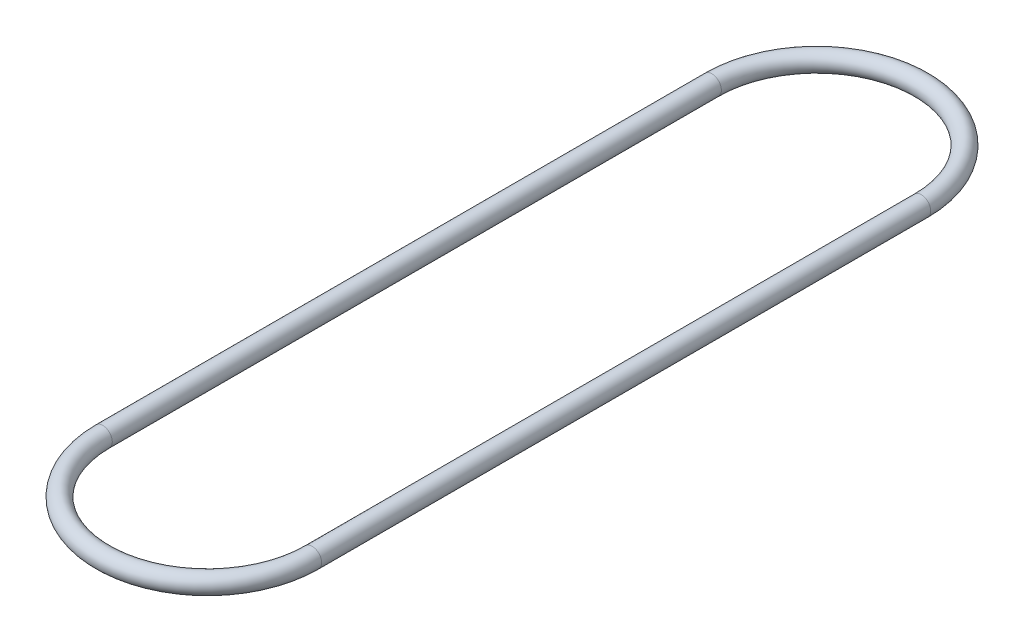
ISO-10303-21;
HEADER;
FILE_DESCRIPTION(('STEP AP214'),'2;1');
FILE_NAME('part.step','',(''),(''),'','','');
FILE_SCHEMA(('AUTOMOTIVE_DESIGN { 1 0 10303 214 1 1 1 1 }'));
ENDSEC;
DATA;
#1=APPLICATION_CONTEXT('core data for automotive mechanical design processes');
#2=APPLICATION_PROTOCOL_DEFINITION('international standard','automotive_design',2000,#1);
#3=PRODUCT_CONTEXT('',#1,'mechanical');
#4=PRODUCT('Part','Part','',(#3));
#5=PRODUCT_RELATED_PRODUCT_CATEGORY('part','',(#4));
#6=PRODUCT_DEFINITION_FORMATION('','',#4);
#7=PRODUCT_DEFINITION_CONTEXT('part definition',#1,'design');
#8=PRODUCT_DEFINITION('design','',#6,#7);
#9=PRODUCT_DEFINITION_SHAPE('','',#8);
#10=(LENGTH_UNIT() NAMED_UNIT(*) SI_UNIT(.MILLI.,.METRE.));
#11=(NAMED_UNIT(*) PLANE_ANGLE_UNIT() SI_UNIT($,.RADIAN.));
#12=(NAMED_UNIT(*) SI_UNIT($,.STERADIAN.) SOLID_ANGLE_UNIT());
#13=UNCERTAINTY_MEASURE_WITH_UNIT(LENGTH_MEASURE(1.E-05),#10,'distance_accuracy_value','');
#14=(GEOMETRIC_REPRESENTATION_CONTEXT(3) GLOBAL_UNCERTAINTY_ASSIGNED_CONTEXT((#13)) GLOBAL_UNIT_ASSIGNED_CONTEXT((#10,
#11,#12)) REPRESENTATION_CONTEXT('',''));
#15=CARTESIAN_POINT('',(0.,0.,0.));
#16=DIRECTION('',(0.,0.,1.));
#17=DIRECTION('',(1.,0.,0.));
#18=AXIS2_PLACEMENT_3D('',#15,#16,#17);
#19=CARTESIAN_POINT('',(0.,0.,-203.2));
#20=DIRECTION('',(0.,0.,1.));
#21=DIRECTION('',(1.,0.,0.));
#22=AXIS2_PLACEMENT_3D('',#19,#20,#21);
#23=CYLINDRICAL_SURFACE('',#22,3.175);
#24=CARTESIAN_POINT('',(0.,0.,0.));
#25=DIRECTION('',(0.,0.,1.));
#26=DIRECTION('',(1.,0.,0.));
#27=AXIS2_PLACEMENT_3D('',#24,#25,#26);
#28=CIRCLE('',#27,3.175);
#29=CARTESIAN_POINT('',(-3.175,0.,0.));
#30=VERTEX_POINT('',#29);
#31=EDGE_CURVE('E47',#30,#30,#28,.T.);
#32=ORIENTED_EDGE('',*,*,#31,.F.);
#33=EDGE_LOOP('',(#32));
#34=FACE_BOUND('',#33,.T.);
#35=CARTESIAN_POINT('',(0.,0.,-203.2));
#36=DIRECTION('',(0.,0.,1.));
#37=DIRECTION('',(1.,0.,0.));
#38=AXIS2_PLACEMENT_3D('',#35,#36,#37);
#39=CIRCLE('',#38,3.175);
#40=CARTESIAN_POINT('',(-3.175,0.,-203.2));
#41=VERTEX_POINT('',#40);
#42=EDGE_CURVE('E10',#41,#41,#39,.T.);
#43=ORIENTED_EDGE('',*,*,#42,.T.);
#44=EDGE_LOOP('',(#43));
#45=FACE_BOUND('',#44,.T.);
#46=ADVANCED_FACE('F32',(#34,#45),#23,.T.);
#47=CARTESIAN_POINT('',(34.925,0.,-203.2));
#48=DIRECTION('',(0.,1.,0.));
#49=DIRECTION('',(0.,0.,1.));
#50=AXIS2_PLACEMENT_3D('',#47,#48,#49);
#51=TOROIDAL_SURFACE('',#50,34.925,3.175);
#52=CARTESIAN_POINT('',(69.85,0.,-203.2));
#53=DIRECTION('',(0.,0.,-1.));
#54=DIRECTION('',(-1.,0.,0.));
#55=AXIS2_PLACEMENT_3D('',#52,#53,#54);
#56=CIRCLE('',#55,3.175);
#57=CARTESIAN_POINT('',(73.025,0.,-203.2));
#58=VERTEX_POINT('',#57);
#59=EDGE_CURVE('E39',#58,#58,#56,.T.);
#60=CARTESIAN_POINT('',(34.925,0.,-203.2));
#61=DIRECTION('',(0.,1.,0.));
#62=DIRECTION('',(0.,0.,1.));
#63=AXIS2_PLACEMENT_3D('',#60,#61,#62);
#64=CIRCLE('',#63,38.1);
#65=EDGE_CURVE('',#58,#41,#64,.T.);
#66=ORIENTED_EDGE('',*,*,#59,.T.);
#67=ORIENTED_EDGE('',*,*,#42,.F.);
#68=ORIENTED_EDGE('',*,*,#65,.T.);
#69=ORIENTED_EDGE('',*,*,#65,.F.);
#70=EDGE_LOOP('',(#66,#68,#67,#69));
#71=FACE_BOUND('',#70,.T.);
#72=ADVANCED_FACE('F56',(#71),#51,.T.);
#73=CARTESIAN_POINT('',(69.85,0.,0.));
#74=DIRECTION('',(0.,0.,-1.));
#75=DIRECTION('',(-1.,0.,0.));
#76=AXIS2_PLACEMENT_3D('',#73,#74,#75);
#77=CYLINDRICAL_SURFACE('',#76,3.175);
#78=ORIENTED_EDGE('',*,*,#59,.F.);
#79=EDGE_LOOP('',(#78));
#80=FACE_BOUND('',#79,.T.);
#81=CARTESIAN_POINT('',(69.85,0.,0.));
#82=DIRECTION('',(0.,0.,-1.));
#83=DIRECTION('',(-1.,0.,0.));
#84=AXIS2_PLACEMENT_3D('',#81,#82,#83);
#85=CIRCLE('',#84,3.175);
#86=CARTESIAN_POINT('',(73.025,0.,0.));
#87=VERTEX_POINT('',#86);
#88=EDGE_CURVE('E43',#87,#87,#85,.T.);
#89=ORIENTED_EDGE('',*,*,#88,.T.);
#90=EDGE_LOOP('',(#89));
#91=FACE_BOUND('',#90,.T.);
#92=ADVANCED_FACE('F60',(#80,#91),#77,.T.);
#93=CARTESIAN_POINT('',(34.925,0.,0.));
#94=DIRECTION('',(0.,1.,0.));
#95=DIRECTION('',(0.,0.,1.));
#96=AXIS2_PLACEMENT_3D('',#93,#94,#95);
#97=TOROIDAL_SURFACE('',#96,34.925,3.175);
#98=CARTESIAN_POINT('',(34.925,0.,0.));
#99=DIRECTION('',(0.,1.,0.));
#100=DIRECTION('',(0.,0.,1.));
#101=AXIS2_PLACEMENT_3D('',#98,#99,#100);
#102=CIRCLE('',#101,38.1);
#103=EDGE_CURVE('',#30,#87,#102,.T.);
#104=ORIENTED_EDGE('',*,*,#31,.T.);
#105=ORIENTED_EDGE('',*,*,#88,.F.);
#106=ORIENTED_EDGE('',*,*,#103,.T.);
#107=ORIENTED_EDGE('',*,*,#103,.F.);
#108=EDGE_LOOP('',(#104,#106,#105,#107));
#109=FACE_BOUND('',#108,.T.);
#110=ADVANCED_FACE('F53',(#109),#97,.T.);
#111=CLOSED_SHELL('',(#46,#72,#92,#110));
#112=MANIFOLD_SOLID_BREP('B2',#111);
#113=ADVANCED_BREP_SHAPE_REPRESENTATION('',(#18,#112),#14);
#114=SHAPE_DEFINITION_REPRESENTATION(#9,#113);
ENDSEC;
END-ISO-10303-21;
